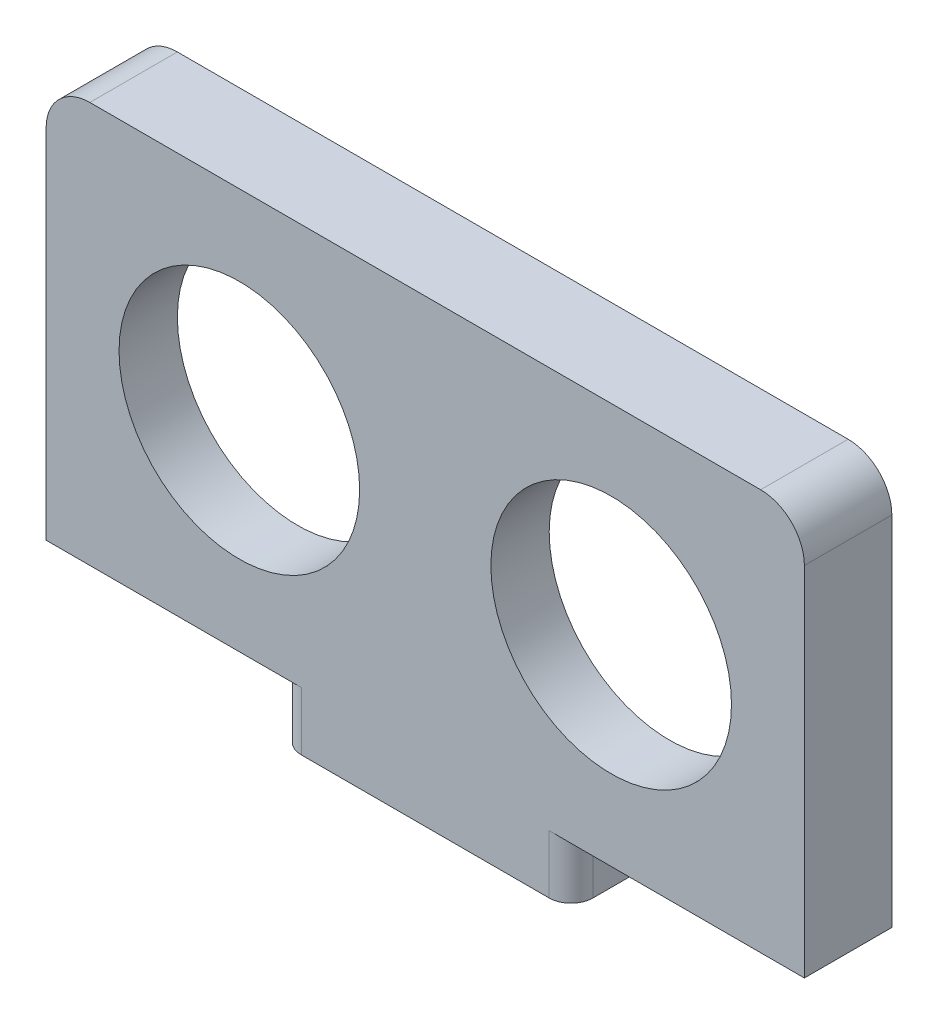
ISO-10303-21;
HEADER;
FILE_DESCRIPTION(('STEP AP214'),'2;1');
FILE_NAME('part.step','',(''),(''),'','','');
FILE_SCHEMA(('AUTOMOTIVE_DESIGN { 1 0 10303 214 1 1 1 1 }'));
ENDSEC;
DATA;
#1=APPLICATION_CONTEXT('core data for automotive mechanical design processes');
#2=APPLICATION_PROTOCOL_DEFINITION('international standard','automotive_design',2000,#1);
#3=PRODUCT_CONTEXT('',#1,'mechanical');
#4=PRODUCT('Part','Part','',(#3));
#5=PRODUCT_RELATED_PRODUCT_CATEGORY('part','',(#4));
#6=PRODUCT_DEFINITION_FORMATION('','',#4);
#7=PRODUCT_DEFINITION_CONTEXT('part definition',#1,'design');
#8=PRODUCT_DEFINITION('design','',#6,#7);
#9=PRODUCT_DEFINITION_SHAPE('','',#8);
#10=(LENGTH_UNIT() NAMED_UNIT(*) SI_UNIT(.MILLI.,.METRE.));
#11=(NAMED_UNIT(*) PLANE_ANGLE_UNIT() SI_UNIT($,.RADIAN.));
#12=(NAMED_UNIT(*) SI_UNIT($,.STERADIAN.) SOLID_ANGLE_UNIT());
#13=UNCERTAINTY_MEASURE_WITH_UNIT(LENGTH_MEASURE(1.E-05),#10,'distance_accuracy_value','');
#14=(GEOMETRIC_REPRESENTATION_CONTEXT(3) GLOBAL_UNCERTAINTY_ASSIGNED_CONTEXT((#13)) GLOBAL_UNIT_ASSIGNED_CONTEXT((#10,
#11,#12)) REPRESENTATION_CONTEXT('',''));
#15=CARTESIAN_POINT('',(0.,0.,0.));
#16=DIRECTION('',(0.,0.,1.));
#17=DIRECTION('',(1.,0.,0.));
#18=AXIS2_PLACEMENT_3D('',#15,#16,#17);
#19=CARTESIAN_POINT('',(26.,-13.75,4.));
#20=DIRECTION('',(0.,-1.,0.));
#21=DIRECTION('',(1.,0.,0.));
#22=AXIS2_PLACEMENT_3D('',#19,#20,#21);
#23=PLANE('',#22);
#24=DIRECTION('',(-1.,0.,0.));
#25=VECTOR('',#24,1.);
#26=CARTESIAN_POINT('',(26.,-13.75,4.));
#27=LINE('',#26,#25);
#28=CARTESIAN_POINT('',(26.,-13.75,4.));
#29=VERTEX_POINT('',#28);
#30=CARTESIAN_POINT('',(8.50000000000001,-13.75,4.));
#31=VERTEX_POINT('',#30);
#32=EDGE_CURVE('E410',#29,#31,#27,.T.);
#33=ORIENTED_EDGE('',*,*,#32,.T.);
#34=CARTESIAN_POINT('',(8.5,-13.75,2.5));
#35=DIRECTION('',(0.,-1.,0.));
#36=DIRECTION('',(1.,0.,0.));
#37=AXIS2_PLACEMENT_3D('',#34,#35,#36);
#38=CIRCLE('',#37,1.5);
#39=CARTESIAN_POINT('',(10.,-13.75,2.5));
#40=VERTEX_POINT('',#39);
#41=EDGE_CURVE('E12',#31,#40,#38,.F.);
#42=ORIENTED_EDGE('',*,*,#41,.T.);
#43=DIRECTION('',(0.,0.,-1.));
#44=VECTOR('',#43,1.);
#45=CARTESIAN_POINT('',(10.,-13.75,4.00000000000001));
#46=LINE('',#45,#44);
#47=CARTESIAN_POINT('',(10.,-13.75,-0.5));
#48=VERTEX_POINT('',#47);
#49=EDGE_CURVE('E521',#40,#48,#46,.T.);
#50=ORIENTED_EDGE('',*,*,#49,.T.);
#51=CARTESIAN_POINT('',(8.5,-13.75,-0.5));
#52=DIRECTION('',(0.,-1.,0.));
#53=DIRECTION('',(1.,0.,0.));
#54=AXIS2_PLACEMENT_3D('',#51,#52,#53);
#55=CIRCLE('',#54,1.5);
#56=CARTESIAN_POINT('',(8.5,-13.75,-2.));
#57=VERTEX_POINT('',#56);
#58=EDGE_CURVE('E75',#48,#57,#55,.F.);
#59=ORIENTED_EDGE('',*,*,#58,.T.);
#60=DIRECTION('',(-1.,0.,0.));
#61=VECTOR('',#60,1.);
#62=CARTESIAN_POINT('',(0.,-13.75,-2.));
#63=LINE('',#62,#61);
#64=CARTESIAN_POINT('',(26.,-13.75,-2.));
#65=VERTEX_POINT('',#64);
#66=EDGE_CURVE('E384',#65,#57,#63,.T.);
#67=ORIENTED_EDGE('',*,*,#66,.F.);
#68=DIRECTION('',(0.,0.,-1.));
#69=VECTOR('',#68,1.);
#70=CARTESIAN_POINT('',(26.,-13.75,4.));
#71=LINE('',#70,#69);
#72=EDGE_CURVE('E408',#29,#65,#71,.T.);
#73=ORIENTED_EDGE('',*,*,#72,.F.);
#74=EDGE_LOOP('',(#33,#42,#50,#59,#67,#73));
#75=FACE_BOUND('',#74,.T.);
#76=ADVANCED_FACE('F67',(#75),#23,.T.);
#77=CARTESIAN_POINT('',(0.,0.,0.));
#78=DIRECTION('',(0.,0.,1.));
#79=DIRECTION('',(1.,0.,0.));
#80=AXIS2_PLACEMENT_3D('',#77,#78,#79);
#81=PLANE('',#80);
#82=CARTESIAN_POINT('',(12.75,0.,0.));
#83=DIRECTION('',(0.,0.,1.));
#84=DIRECTION('',(1.,0.,0.));
#85=AXIS2_PLACEMENT_3D('',#82,#83,#84);
#86=CIRCLE('',#85,8.25);
#87=CARTESIAN_POINT('',(21.,0.,0.));
#88=VERTEX_POINT('',#87);
#89=EDGE_CURVE('E443',#88,#88,#86,.T.);
#90=ORIENTED_EDGE('',*,*,#89,.T.);
#91=EDGE_LOOP('',(#90));
#92=FACE_BOUND('',#91,.T.);
#93=CARTESIAN_POINT('',(-12.75,0.,0.));
#94=DIRECTION('',(0.,0.,1.));
#95=DIRECTION('',(1.,0.,0.));
#96=AXIS2_PLACEMENT_3D('',#93,#94,#95);
#97=CIRCLE('',#96,8.25);
#98=CARTESIAN_POINT('',(-4.5,0.,0.));
#99=VERTEX_POINT('',#98);
#100=EDGE_CURVE('E437',#99,#99,#97,.T.);
#101=ORIENTED_EDGE('',*,*,#100,.T.);
#102=EDGE_LOOP('',(#101));
#103=FACE_BOUND('',#102,.T.);
#104=CARTESIAN_POINT('',(-4.5,-5.75000000000001,0.));
#105=DIRECTION('',(0.,0.,1.));
#106=DIRECTION('',(1.,0.,0.));
#107=AXIS2_PLACEMENT_3D('',#104,#105,#106);
#108=CIRCLE('',#107,1.);
#109=CARTESIAN_POINT('',(-5.5,-5.75000000000001,0.));
#110=VERTEX_POINT('',#109);
#111=CARTESIAN_POINT('',(-4.5,-4.75000000000001,0.));
#112=VERTEX_POINT('',#111);
#113=EDGE_CURVE('E302',#110,#112,#108,.F.);
#114=ORIENTED_EDGE('',*,*,#113,.F.);
#115=DIRECTION('',(0.,1.,0.));
#116=VECTOR('',#115,1.);
#117=CARTESIAN_POINT('',(-5.5,0.,0.));
#118=LINE('',#117,#116);
#119=CARTESIAN_POINT('',(-5.5,-10.75,0.));
#120=VERTEX_POINT('',#119);
#121=EDGE_CURVE('E271',#120,#110,#118,.T.);
#122=ORIENTED_EDGE('',*,*,#121,.F.);
#123=DIRECTION('',(-1.,0.,0.));
#124=VECTOR('',#123,1.);
#125=CARTESIAN_POINT('',(0.,-10.75,0.));
#126=LINE('',#125,#124);
#127=CARTESIAN_POINT('',(-23.,-10.75,0.));
#128=VERTEX_POINT('',#127);
#129=EDGE_CURVE('E363',#120,#128,#126,.T.);
#130=ORIENTED_EDGE('',*,*,#129,.T.);
#131=DIRECTION('',(0.,1.,0.));
#132=VECTOR('',#131,1.);
#133=CARTESIAN_POINT('',(-23.,0.,0.));
#134=LINE('',#133,#132);
#135=CARTESIAN_POINT('',(-23.,10.75,0.));
#136=VERTEX_POINT('',#135);
#137=EDGE_CURVE('E465',#128,#136,#134,.T.);
#138=ORIENTED_EDGE('',*,*,#137,.T.);
#139=DIRECTION('',(-1.,0.,0.));
#140=VECTOR('',#139,1.);
#141=CARTESIAN_POINT('',(0.,10.75,0.));
#142=LINE('',#141,#140);
#143=CARTESIAN_POINT('',(-5.5,10.75,0.));
#144=VERTEX_POINT('',#143);
#145=EDGE_CURVE('E464',#144,#136,#142,.T.);
#146=ORIENTED_EDGE('',*,*,#145,.F.);
#147=DIRECTION('',(0.,-1.,0.));
#148=VECTOR('',#147,1.);
#149=CARTESIAN_POINT('',(-5.5,0.,0.));
#150=LINE('',#149,#148);
#151=CARTESIAN_POINT('',(-5.5,5.75000000000001,0.));
#152=VERTEX_POINT('',#151);
#153=EDGE_CURVE('E275',#144,#152,#150,.T.);
#154=ORIENTED_EDGE('',*,*,#153,.T.);
#155=CARTESIAN_POINT('',(-4.5,5.75000000000001,0.));
#156=DIRECTION('',(0.,0.,1.));
#157=DIRECTION('',(1.,0.,0.));
#158=AXIS2_PLACEMENT_3D('',#155,#156,#157);
#159=CIRCLE('',#158,1.);
#160=CARTESIAN_POINT('',(-4.5,4.75000000000001,0.));
#161=VERTEX_POINT('',#160);
#162=EDGE_CURVE('E339',#152,#161,#159,.T.);
#163=ORIENTED_EDGE('',*,*,#162,.T.);
#164=DIRECTION('',(1.,0.,0.));
#165=VECTOR('',#164,1.);
#166=CARTESIAN_POINT('',(0.,4.75000000000001,0.));
#167=LINE('',#166,#165);
#168=CARTESIAN_POINT('',(4.5,4.75000000000001,0.));
#169=VERTEX_POINT('',#168);
#170=EDGE_CURVE('E342',#161,#169,#167,.T.);
#171=ORIENTED_EDGE('',*,*,#170,.T.);
#172=CARTESIAN_POINT('',(4.5,5.75000000000001,0.));
#173=DIRECTION('',(0.,0.,1.));
#174=DIRECTION('',(1.,0.,0.));
#175=AXIS2_PLACEMENT_3D('',#172,#173,#174);
#176=CIRCLE('',#175,1.);
#177=CARTESIAN_POINT('',(5.5,5.75000000000001,0.));
#178=VERTEX_POINT('',#177);
#179=EDGE_CURVE('E345',#169,#178,#176,.T.);
#180=ORIENTED_EDGE('',*,*,#179,.T.);
#181=DIRECTION('',(0.,1.,0.));
#182=VECTOR('',#181,1.);
#183=CARTESIAN_POINT('',(5.5,0.,0.));
#184=LINE('',#183,#182);
#185=CARTESIAN_POINT('',(5.5,10.75,0.));
#186=VERTEX_POINT('',#185);
#187=EDGE_CURVE('E326',#178,#186,#184,.T.);
#188=ORIENTED_EDGE('',*,*,#187,.T.);
#189=CARTESIAN_POINT('',(23.,10.75,0.));
#190=VERTEX_POINT('',#189);
#191=EDGE_CURVE('E461',#190,#186,#142,.T.);
#192=ORIENTED_EDGE('',*,*,#191,.F.);
#193=DIRECTION('',(0.,1.,0.));
#194=VECTOR('',#193,1.);
#195=CARTESIAN_POINT('',(23.,0.,0.));
#196=LINE('',#195,#194);
#197=CARTESIAN_POINT('',(23.,-10.75,0.));
#198=VERTEX_POINT('',#197);
#199=EDGE_CURVE('E368',#198,#190,#196,.T.);
#200=ORIENTED_EDGE('',*,*,#199,.F.);
#201=CARTESIAN_POINT('',(5.5,-10.75,0.));
#202=VERTEX_POINT('',#201);
#203=EDGE_CURVE('E468',#198,#202,#126,.T.);
#204=ORIENTED_EDGE('',*,*,#203,.T.);
#205=DIRECTION('',(0.,-1.,0.));
#206=VECTOR('',#205,1.);
#207=CARTESIAN_POINT('',(5.5,0.,0.));
#208=LINE('',#207,#206);
#209=CARTESIAN_POINT('',(5.5,-5.75000000000001,0.));
#210=VERTEX_POINT('',#209);
#211=EDGE_CURVE('E306',#210,#202,#208,.T.);
#212=ORIENTED_EDGE('',*,*,#211,.F.);
#213=CARTESIAN_POINT('',(4.5,-5.75000000000001,0.));
#214=DIRECTION('',(0.,0.,1.));
#215=DIRECTION('',(1.,0.,0.));
#216=AXIS2_PLACEMENT_3D('',#213,#214,#215);
#217=CIRCLE('',#216,1.);
#218=CARTESIAN_POINT('',(4.5,-4.75000000000001,0.));
#219=VERTEX_POINT('',#218);
#220=EDGE_CURVE('E308',#219,#210,#217,.F.);
#221=ORIENTED_EDGE('',*,*,#220,.F.);
#222=DIRECTION('',(1.,0.,0.));
#223=VECTOR('',#222,1.);
#224=CARTESIAN_POINT('',(0.,-4.75000000000001,0.));
#225=LINE('',#224,#223);
#226=EDGE_CURVE('E285',#112,#219,#225,.T.);
#227=ORIENTED_EDGE('',*,*,#226,.F.);
#228=EDGE_LOOP('',(#114,#122,#130,#138,#146,#154,#163,#171,#180,#188,#192,#200,#204,#212,#221,#227));
#229=FACE_BOUND('',#228,.T.);
#230=ADVANCED_FACE('F575',(#92,#103,#229),#81,.F.);
#231=CARTESIAN_POINT('',(0.,0.,4.));
#232=DIRECTION('',(0.,0.,1.));
#233=DIRECTION('',(1.,0.,0.));
#234=AXIS2_PLACEMENT_3D('',#231,#232,#233);
#235=PLANE('',#234);
#236=CARTESIAN_POINT('',(-12.75,0.,4.));
#237=DIRECTION('',(0.,0.,1.));
#238=DIRECTION('',(1.,0.,0.));
#239=AXIS2_PLACEMENT_3D('',#236,#237,#238);
#240=CIRCLE('',#239,8.25);
#241=CARTESIAN_POINT('',(-4.5,0.,4.));
#242=VERTEX_POINT('',#241);
#243=EDGE_CURVE('E434',#242,#242,#240,.T.);
#244=ORIENTED_EDGE('',*,*,#243,.F.);
#245=EDGE_LOOP('',(#244));
#246=FACE_BOUND('',#245,.T.);
#247=CARTESIAN_POINT('',(-8.5,-13.75,4.));
#248=VERTEX_POINT('',#247);
#249=CARTESIAN_POINT('',(-26.,-13.75,4.));
#250=VERTEX_POINT('',#249);
#251=EDGE_CURVE('E417',#248,#250,#27,.T.);
#252=ORIENTED_EDGE('',*,*,#251,.F.);
#253=DIRECTION('',(0.,1.,0.));
#254=VECTOR('',#253,1.);
#255=CARTESIAN_POINT('',(-8.5,-17.75,4.));
#256=LINE('',#255,#254);
#257=CARTESIAN_POINT('',(-8.5,-17.75,4.));
#258=VERTEX_POINT('',#257);
#259=EDGE_CURVE('E496',#248,#258,#256,.F.);
#260=ORIENTED_EDGE('',*,*,#259,.T.);
#261=DIRECTION('',(1.,0.,0.));
#262=VECTOR('',#261,1.);
#263=CARTESIAN_POINT('',(-10.,-17.75,4.));
#264=LINE('',#263,#262);
#265=CARTESIAN_POINT('',(8.5,-17.75,4.00000000000001));
#266=VERTEX_POINT('',#265);
#267=EDGE_CURVE('E531',#258,#266,#264,.T.);
#268=ORIENTED_EDGE('',*,*,#267,.T.);
#269=DIRECTION('',(0.,1.,0.));
#270=VECTOR('',#269,1.);
#271=CARTESIAN_POINT('',(8.5,0.,4.));
#272=LINE('',#271,#270);
#273=EDGE_CURVE('E512',#266,#31,#272,.T.);
#274=ORIENTED_EDGE('',*,*,#273,.T.);
#275=ORIENTED_EDGE('',*,*,#32,.F.);
#276=DIRECTION('',(0.,1.,0.));
#277=VECTOR('',#276,1.);
#278=CARTESIAN_POINT('',(26.,-13.75,4.));
#279=LINE('',#278,#277);
#280=CARTESIAN_POINT('',(26.,10.75,4.));
#281=VERTEX_POINT('',#280);
#282=EDGE_CURVE('E429',#29,#281,#279,.T.);
#283=ORIENTED_EDGE('',*,*,#282,.T.);
#284=CARTESIAN_POINT('',(23.,10.75,4.));
#285=DIRECTION('',(0.,0.,1.));
#286=DIRECTION('',(1.,0.,0.));
#287=AXIS2_PLACEMENT_3D('',#284,#285,#286);
#288=CIRCLE('',#287,3.);
#289=CARTESIAN_POINT('',(23.,13.75,4.));
#290=VERTEX_POINT('',#289);
#291=EDGE_CURVE('E391',#281,#290,#288,.T.);
#292=ORIENTED_EDGE('',*,*,#291,.T.);
#293=DIRECTION('',(-1.,0.,0.));
#294=VECTOR('',#293,1.);
#295=CARTESIAN_POINT('',(26.,13.75,4.));
#296=LINE('',#295,#294);
#297=CARTESIAN_POINT('',(-23.,13.75,4.));
#298=VERTEX_POINT('',#297);
#299=EDGE_CURVE('E424',#290,#298,#296,.T.);
#300=ORIENTED_EDGE('',*,*,#299,.T.);
#301=CARTESIAN_POINT('',(-23.,10.75,4.));
#302=DIRECTION('',(0.,0.,1.));
#303=DIRECTION('',(1.,0.,0.));
#304=AXIS2_PLACEMENT_3D('',#301,#302,#303);
#305=CIRCLE('',#304,3.);
#306=CARTESIAN_POINT('',(-26.,10.75,4.));
#307=VERTEX_POINT('',#306);
#308=EDGE_CURVE('E389',#298,#307,#305,.T.);
#309=ORIENTED_EDGE('',*,*,#308,.T.);
#310=DIRECTION('',(0.,1.,0.));
#311=VECTOR('',#310,1.);
#312=CARTESIAN_POINT('',(-26.,-13.75,4.));
#313=LINE('',#312,#311);
#314=EDGE_CURVE('E413',#250,#307,#313,.T.);
#315=ORIENTED_EDGE('',*,*,#314,.F.);
#316=EDGE_LOOP('',(#252,#260,#268,#274,#275,#283,#292,#300,#309,#315));
#317=FACE_BOUND('',#316,.T.);
#318=CARTESIAN_POINT('',(12.75,0.,4.));
#319=DIRECTION('',(0.,0.,1.));
#320=DIRECTION('',(1.,0.,0.));
#321=AXIS2_PLACEMENT_3D('',#318,#319,#320);
#322=CIRCLE('',#321,8.25);
#323=CARTESIAN_POINT('',(21.,0.,4.));
#324=VERTEX_POINT('',#323);
#325=EDGE_CURVE('E440',#324,#324,#322,.T.);
#326=ORIENTED_EDGE('',*,*,#325,.F.);
#327=EDGE_LOOP('',(#326));
#328=FACE_BOUND('',#327,.T.);
#329=ADVANCED_FACE('F489',(#246,#317,#328),#235,.T.);
#330=CARTESIAN_POINT('',(26.,-13.75,4.));
#331=DIRECTION('',(-1.,0.,0.));
#332=DIRECTION('',(0.,0.,1.));
#333=AXIS2_PLACEMENT_3D('',#330,#331,#332);
#334=PLANE('',#333);
#335=DIRECTION('',(0.,1.,0.));
#336=VECTOR('',#335,1.);
#337=CARTESIAN_POINT('',(26.,0.,-2.));
#338=LINE('',#337,#336);
#339=CARTESIAN_POINT('',(26.,10.75,-2.));
#340=VERTEX_POINT('',#339);
#341=EDGE_CURVE('E378',#65,#340,#338,.T.);
#342=ORIENTED_EDGE('',*,*,#341,.T.);
#343=DIRECTION('',(0.,0.,-1.));
#344=VECTOR('',#343,1.);
#345=CARTESIAN_POINT('',(26.,10.75,4.));
#346=LINE('',#345,#344);
#347=EDGE_CURVE('E386',#340,#281,#346,.F.);
#348=ORIENTED_EDGE('',*,*,#347,.T.);
#349=ORIENTED_EDGE('',*,*,#282,.F.);
#350=ORIENTED_EDGE('',*,*,#72,.T.);
#351=EDGE_LOOP('',(#342,#348,#349,#350));
#352=FACE_BOUND('',#351,.T.);
#353=ADVANCED_FACE('F481',(#352),#334,.F.);
#354=CARTESIAN_POINT('',(26.,13.75,4.));
#355=DIRECTION('',(0.,-1.,0.));
#356=DIRECTION('',(1.,0.,0.));
#357=AXIS2_PLACEMENT_3D('',#354,#355,#356);
#358=PLANE('',#357);
#359=DIRECTION('',(-1.,0.,0.));
#360=VECTOR('',#359,1.);
#361=CARTESIAN_POINT('',(0.,13.75,-2.));
#362=LINE('',#361,#360);
#363=CARTESIAN_POINT('',(23.,13.75,-2.));
#364=VERTEX_POINT('',#363);
#365=CARTESIAN_POINT('',(-23.,13.75,-2.));
#366=VERTEX_POINT('',#365);
#367=EDGE_CURVE('E472',#364,#366,#362,.T.);
#368=ORIENTED_EDGE('',*,*,#367,.T.);
#369=DIRECTION('',(0.,0.,-1.));
#370=VECTOR('',#369,1.);
#371=CARTESIAN_POINT('',(-23.,13.75,4.));
#372=LINE('',#371,#370);
#373=EDGE_CURVE('E393',#366,#298,#372,.F.);
#374=ORIENTED_EDGE('',*,*,#373,.T.);
#375=ORIENTED_EDGE('',*,*,#299,.F.);
#376=DIRECTION('',(0.,0.,-1.));
#377=VECTOR('',#376,1.);
#378=CARTESIAN_POINT('',(23.,13.75,4.));
#379=LINE('',#378,#377);
#380=EDGE_CURVE('E395',#290,#364,#379,.T.);
#381=ORIENTED_EDGE('',*,*,#380,.T.);
#382=EDGE_LOOP('',(#368,#374,#375,#381));
#383=FACE_BOUND('',#382,.T.);
#384=ADVANCED_FACE('F491',(#383),#358,.F.);
#385=CARTESIAN_POINT('',(-26.,-13.75,4.));
#386=DIRECTION('',(-1.,0.,0.));
#387=DIRECTION('',(0.,0.,1.));
#388=AXIS2_PLACEMENT_3D('',#385,#386,#387);
#389=PLANE('',#388);
#390=ORIENTED_EDGE('',*,*,#314,.T.);
#391=DIRECTION('',(0.,0.,-1.));
#392=VECTOR('',#391,1.);
#393=CARTESIAN_POINT('',(-26.,10.75,-2.));
#394=LINE('',#393,#392);
#395=CARTESIAN_POINT('',(-26.,10.75,-2.));
#396=VERTEX_POINT('',#395);
#397=EDGE_CURVE('E402',#307,#396,#394,.T.);
#398=ORIENTED_EDGE('',*,*,#397,.T.);
#399=DIRECTION('',(0.,1.,0.));
#400=VECTOR('',#399,1.);
#401=CARTESIAN_POINT('',(-26.,0.,-2.));
#402=LINE('',#401,#400);
#403=CARTESIAN_POINT('',(-26.,-13.75,-2.));
#404=VERTEX_POINT('',#403);
#405=EDGE_CURVE('E453',#404,#396,#402,.T.);
#406=ORIENTED_EDGE('',*,*,#405,.F.);
#407=DIRECTION('',(0.,0.,-1.));
#408=VECTOR('',#407,1.);
#409=CARTESIAN_POINT('',(-26.,-13.75,4.));
#410=LINE('',#409,#408);
#411=EDGE_CURVE('E405',#250,#404,#410,.T.);
#412=ORIENTED_EDGE('',*,*,#411,.F.);
#413=EDGE_LOOP('',(#390,#398,#406,#412));
#414=FACE_BOUND('',#413,.T.);
#415=ADVANCED_FACE('F585',(#414),#389,.T.);
#416=DIRECTION('',(0.,0.,-1.));
#417=VECTOR('',#416,1.);
#418=CARTESIAN_POINT('',(-10.,-13.75,4.));
#419=LINE('',#418,#417);
#420=CARTESIAN_POINT('',(-10.,-13.75,2.5));
#421=VERTEX_POINT('',#420);
#422=CARTESIAN_POINT('',(-10.,-13.75,-0.5));
#423=VERTEX_POINT('',#422);
#424=EDGE_CURVE('E502',#421,#423,#419,.T.);
#425=ORIENTED_EDGE('',*,*,#424,.F.);
#426=CARTESIAN_POINT('',(-8.5,-13.75,2.5));
#427=DIRECTION('',(0.,-1.,0.));
#428=DIRECTION('',(1.,0.,0.));
#429=AXIS2_PLACEMENT_3D('',#426,#427,#428);
#430=CIRCLE('',#429,1.5);
#431=EDGE_CURVE('E499',#421,#248,#430,.F.);
#432=ORIENTED_EDGE('',*,*,#431,.T.);
#433=ORIENTED_EDGE('',*,*,#251,.T.);
#434=ORIENTED_EDGE('',*,*,#411,.T.);
#435=CARTESIAN_POINT('',(-8.5,-13.75,-2.));
#436=VERTEX_POINT('',#435);
#437=EDGE_CURVE('E375',#436,#404,#63,.T.);
#438=ORIENTED_EDGE('',*,*,#437,.F.);
#439=CARTESIAN_POINT('',(-8.5,-13.75,-0.5));
#440=DIRECTION('',(0.,-1.,0.));
#441=DIRECTION('',(1.,0.,0.));
#442=AXIS2_PLACEMENT_3D('',#439,#440,#441);
#443=CIRCLE('',#442,1.5);
#444=EDGE_CURVE('E506',#436,#423,#443,.F.);
#445=ORIENTED_EDGE('',*,*,#444,.T.);
#446=EDGE_LOOP('',(#425,#432,#433,#434,#438,#445));
#447=FACE_BOUND('',#446,.T.);
#448=ADVANCED_FACE('F500',(#447),#23,.T.);
#449=CARTESIAN_POINT('',(-12.75,0.,4.));
#450=DIRECTION('',(0.,0.,-1.));
#451=DIRECTION('',(-1.,0.,0.));
#452=AXIS2_PLACEMENT_3D('',#449,#450,#451);
#453=CYLINDRICAL_SURFACE('',#452,8.25);
#454=ORIENTED_EDGE('',*,*,#243,.T.);
#455=EDGE_LOOP('',(#454));
#456=FACE_BOUND('',#455,.T.);
#457=ORIENTED_EDGE('',*,*,#100,.F.);
#458=EDGE_LOOP('',(#457));
#459=FACE_BOUND('',#458,.T.);
#460=ADVANCED_FACE('F584',(#456,#459),#453,.F.);
#461=CARTESIAN_POINT('',(12.75,0.,4.));
#462=DIRECTION('',(0.,0.,-1.));
#463=DIRECTION('',(-1.,0.,0.));
#464=AXIS2_PLACEMENT_3D('',#461,#462,#463);
#465=CYLINDRICAL_SURFACE('',#464,8.25);
#466=ORIENTED_EDGE('',*,*,#325,.T.);
#467=EDGE_LOOP('',(#466));
#468=FACE_BOUND('',#467,.T.);
#469=ORIENTED_EDGE('',*,*,#89,.F.);
#470=EDGE_LOOP('',(#469));
#471=FACE_BOUND('',#470,.T.);
#472=ADVANCED_FACE('F590',(#468,#471),#465,.F.);
#473=CARTESIAN_POINT('',(0.,-10.75,-2.));
#474=DIRECTION('',(0.,1.,0.));
#475=DIRECTION('',(-1.,0.,0.));
#476=AXIS2_PLACEMENT_3D('',#473,#474,#475);
#477=PLANE('',#476);
#478=ORIENTED_EDGE('',*,*,#203,.F.);
#479=DIRECTION('',(0.,0.,1.));
#480=VECTOR('',#479,1.);
#481=CARTESIAN_POINT('',(23.,-10.75,-2.));
#482=LINE('',#481,#480);
#483=CARTESIAN_POINT('',(23.,-10.75,-2.));
#484=VERTEX_POINT('',#483);
#485=EDGE_CURVE('E446',#484,#198,#482,.T.);
#486=ORIENTED_EDGE('',*,*,#485,.F.);
#487=DIRECTION('',(-1.,0.,0.));
#488=VECTOR('',#487,1.);
#489=CARTESIAN_POINT('',(0.,-10.75,-2.));
#490=LINE('',#489,#488);
#491=CARTESIAN_POINT('',(-23.,-10.75,-2.));
#492=VERTEX_POINT('',#491);
#493=EDGE_CURVE('E364',#484,#492,#490,.T.);
#494=ORIENTED_EDGE('',*,*,#493,.T.);
#495=DIRECTION('',(0.,0.,1.));
#496=VECTOR('',#495,1.);
#497=CARTESIAN_POINT('',(-23.,-10.75,-2.));
#498=LINE('',#497,#496);
#499=EDGE_CURVE('E449',#492,#128,#498,.T.);
#500=ORIENTED_EDGE('',*,*,#499,.T.);
#501=ORIENTED_EDGE('',*,*,#129,.F.);
#502=DIRECTION('',(0.,0.,-1.));
#503=VECTOR('',#502,1.);
#504=CARTESIAN_POINT('',(-5.5,-10.75,3.));
#505=LINE('',#504,#503);
#506=CARTESIAN_POINT('',(-5.5,-10.75,3.));
#507=VERTEX_POINT('',#506);
#508=EDGE_CURVE('E276',#507,#120,#505,.T.);
#509=ORIENTED_EDGE('',*,*,#508,.F.);
#510=DIRECTION('',(-1.,0.,0.));
#511=VECTOR('',#510,1.);
#512=CARTESIAN_POINT('',(0.,-10.75,3.));
#513=LINE('',#512,#511);
#514=CARTESIAN_POINT('',(5.5,-10.75,3.));
#515=VERTEX_POINT('',#514);
#516=EDGE_CURVE('E290',#515,#507,#513,.T.);
#517=ORIENTED_EDGE('',*,*,#516,.F.);
#518=DIRECTION('',(0.,0.,-1.));
#519=VECTOR('',#518,1.);
#520=CARTESIAN_POINT('',(5.5,-10.75,3.));
#521=LINE('',#520,#519);
#522=EDGE_CURVE('E318',#515,#202,#521,.T.);
#523=ORIENTED_EDGE('',*,*,#522,.T.);
#524=EDGE_LOOP('',(#478,#486,#494,#500,#501,#509,#517,#523));
#525=FACE_BOUND('',#524,.T.);
#526=ADVANCED_FACE('F847',(#525),#477,.T.);
#527=CARTESIAN_POINT('',(23.,0.,-2.));
#528=DIRECTION('',(1.,0.,0.));
#529=DIRECTION('',(0.,0.,-1.));
#530=AXIS2_PLACEMENT_3D('',#527,#528,#529);
#531=PLANE('',#530);
#532=ORIENTED_EDGE('',*,*,#199,.T.);
#533=DIRECTION('',(0.,0.,1.));
#534=VECTOR('',#533,1.);
#535=CARTESIAN_POINT('',(23.,10.75,-2.));
#536=LINE('',#535,#534);
#537=CARTESIAN_POINT('',(23.,10.75,-2.));
#538=VERTEX_POINT('',#537);
#539=EDGE_CURVE('E456',#538,#190,#536,.T.);
#540=ORIENTED_EDGE('',*,*,#539,.F.);
#541=DIRECTION('',(0.,1.,0.));
#542=VECTOR('',#541,1.);
#543=CARTESIAN_POINT('',(23.,0.,-2.));
#544=LINE('',#543,#542);
#545=EDGE_CURVE('E373',#484,#538,#544,.T.);
#546=ORIENTED_EDGE('',*,*,#545,.F.);
#547=ORIENTED_EDGE('',*,*,#485,.T.);
#548=EDGE_LOOP('',(#532,#540,#546,#547));
#549=FACE_BOUND('',#548,.T.);
#550=ADVANCED_FACE('F837',(#549),#531,.F.);
#551=CARTESIAN_POINT('',(0.,10.75,-2.));
#552=DIRECTION('',(0.,1.,0.));
#553=DIRECTION('',(-1.,0.,0.));
#554=AXIS2_PLACEMENT_3D('',#551,#552,#553);
#555=PLANE('',#554);
#556=ORIENTED_EDGE('',*,*,#191,.T.);
#557=DIRECTION('',(0.,0.,-1.));
#558=VECTOR('',#557,1.);
#559=CARTESIAN_POINT('',(5.5,10.75,3.));
#560=LINE('',#559,#558);
#561=CARTESIAN_POINT('',(5.5,10.75,3.));
#562=VERTEX_POINT('',#561);
#563=EDGE_CURVE('E352',#562,#186,#560,.T.);
#564=ORIENTED_EDGE('',*,*,#563,.F.);
#565=DIRECTION('',(-1.,0.,0.));
#566=VECTOR('',#565,1.);
#567=CARTESIAN_POINT('',(0.,10.75,3.));
#568=LINE('',#567,#566);
#569=CARTESIAN_POINT('',(-5.5,10.75,3.));
#570=VERTEX_POINT('',#569);
#571=EDGE_CURVE('E334',#562,#570,#568,.T.);
#572=ORIENTED_EDGE('',*,*,#571,.T.);
#573=DIRECTION('',(0.,0.,-1.));
#574=VECTOR('',#573,1.);
#575=CARTESIAN_POINT('',(-5.5,10.75,3.));
#576=LINE('',#575,#574);
#577=EDGE_CURVE('E336',#570,#144,#576,.T.);
#578=ORIENTED_EDGE('',*,*,#577,.T.);
#579=ORIENTED_EDGE('',*,*,#145,.T.);
#580=DIRECTION('',(0.,0.,1.));
#581=VECTOR('',#580,1.);
#582=CARTESIAN_POINT('',(-23.,10.75,-2.));
#583=LINE('',#582,#581);
#584=CARTESIAN_POINT('',(-23.,10.75,-2.));
#585=VERTEX_POINT('',#584);
#586=EDGE_CURVE('E452',#585,#136,#583,.T.);
#587=ORIENTED_EDGE('',*,*,#586,.F.);
#588=DIRECTION('',(-1.,0.,0.));
#589=VECTOR('',#588,1.);
#590=CARTESIAN_POINT('',(0.,10.75,-2.));
#591=LINE('',#590,#589);
#592=EDGE_CURVE('E371',#538,#585,#591,.T.);
#593=ORIENTED_EDGE('',*,*,#592,.F.);
#594=ORIENTED_EDGE('',*,*,#539,.T.);
#595=EDGE_LOOP('',(#556,#564,#572,#578,#579,#587,#593,#594));
#596=FACE_BOUND('',#595,.T.);
#597=ADVANCED_FACE('F833',(#596),#555,.F.);
#598=CARTESIAN_POINT('',(-23.,0.,-2.));
#599=DIRECTION('',(1.,0.,0.));
#600=DIRECTION('',(0.,0.,-1.));
#601=AXIS2_PLACEMENT_3D('',#598,#599,#600);
#602=PLANE('',#601);
#603=ORIENTED_EDGE('',*,*,#137,.F.);
#604=ORIENTED_EDGE('',*,*,#499,.F.);
#605=DIRECTION('',(0.,1.,0.));
#606=VECTOR('',#605,1.);
#607=CARTESIAN_POINT('',(-23.,0.,-2.));
#608=LINE('',#607,#606);
#609=EDGE_CURVE('E367',#492,#585,#608,.T.);
#610=ORIENTED_EDGE('',*,*,#609,.T.);
#611=ORIENTED_EDGE('',*,*,#586,.T.);
#612=EDGE_LOOP('',(#603,#604,#610,#611));
#613=FACE_BOUND('',#612,.T.);
#614=ADVANCED_FACE('F660',(#613),#602,.T.);
#615=CARTESIAN_POINT('',(0.,0.,-2.));
#616=DIRECTION('',(0.,0.,1.));
#617=DIRECTION('',(1.,0.,0.));
#618=AXIS2_PLACEMENT_3D('',#615,#616,#617);
#619=PLANE('',#618);
#620=ORIENTED_EDGE('',*,*,#493,.F.);
#621=ORIENTED_EDGE('',*,*,#545,.T.);
#622=ORIENTED_EDGE('',*,*,#592,.T.);
#623=ORIENTED_EDGE('',*,*,#609,.F.);
#624=EDGE_LOOP('',(#620,#621,#622,#623));
#625=FACE_BOUND('',#624,.T.);
#626=DIRECTION('',(1.,0.,0.));
#627=VECTOR('',#626,1.);
#628=CARTESIAN_POINT('',(-10.,-17.75,-2.));
#629=LINE('',#628,#627);
#630=CARTESIAN_POINT('',(-8.5,-17.75,-2.));
#631=VERTEX_POINT('',#630);
#632=CARTESIAN_POINT('',(8.5,-17.75,-2.));
#633=VERTEX_POINT('',#632);
#634=EDGE_CURVE('E547',#631,#633,#629,.T.);
#635=ORIENTED_EDGE('',*,*,#634,.F.);
#636=DIRECTION('',(0.,1.,0.));
#637=VECTOR('',#636,1.);
#638=CARTESIAN_POINT('',(-8.5,0.,-2.));
#639=LINE('',#638,#637);
#640=EDGE_CURVE('E532',#631,#436,#639,.T.);
#641=ORIENTED_EDGE('',*,*,#640,.T.);
#642=ORIENTED_EDGE('',*,*,#437,.T.);
#643=ORIENTED_EDGE('',*,*,#405,.T.);
#644=CARTESIAN_POINT('',(-23.,10.75,-2.));
#645=DIRECTION('',(0.,0.,1.));
#646=DIRECTION('',(1.,0.,0.));
#647=AXIS2_PLACEMENT_3D('',#644,#645,#646);
#648=CIRCLE('',#647,3.);
#649=EDGE_CURVE('E398',#396,#366,#648,.F.);
#650=ORIENTED_EDGE('',*,*,#649,.T.);
#651=ORIENTED_EDGE('',*,*,#367,.F.);
#652=CARTESIAN_POINT('',(23.,10.75,-2.));
#653=DIRECTION('',(0.,0.,1.));
#654=DIRECTION('',(1.,0.,0.));
#655=AXIS2_PLACEMENT_3D('',#652,#653,#654);
#656=CIRCLE('',#655,3.);
#657=EDGE_CURVE('E400',#364,#340,#656,.F.);
#658=ORIENTED_EDGE('',*,*,#657,.T.);
#659=ORIENTED_EDGE('',*,*,#341,.F.);
#660=ORIENTED_EDGE('',*,*,#66,.T.);
#661=DIRECTION('',(0.,1.,0.));
#662=VECTOR('',#661,1.);
#663=CARTESIAN_POINT('',(8.5,-17.75,-2.));
#664=LINE('',#663,#662);
#665=EDGE_CURVE('E388',#57,#633,#664,.F.);
#666=ORIENTED_EDGE('',*,*,#665,.T.);
#667=EDGE_LOOP('',(#635,#641,#642,#643,#650,#651,#658,#659,#660,#666));
#668=FACE_BOUND('',#667,.T.);
#669=ADVANCED_FACE('F554',(#625,#668),#619,.F.);
#670=CARTESIAN_POINT('',(-5.5,0.,3.));
#671=DIRECTION('',(1.,0.,0.));
#672=DIRECTION('',(0.,0.,-1.));
#673=AXIS2_PLACEMENT_3D('',#670,#671,#672);
#674=PLANE('',#673);
#675=ORIENTED_EDGE('',*,*,#153,.F.);
#676=ORIENTED_EDGE('',*,*,#577,.F.);
#677=DIRECTION('',(0.,-1.,0.));
#678=VECTOR('',#677,1.);
#679=CARTESIAN_POINT('',(-5.5,0.,3.));
#680=LINE('',#679,#678);
#681=CARTESIAN_POINT('',(-5.5,5.75000000000001,3.));
#682=VERTEX_POINT('',#681);
#683=EDGE_CURVE('E322',#570,#682,#680,.T.);
#684=ORIENTED_EDGE('',*,*,#683,.T.);
#685=DIRECTION('',(0.,0.,-1.));
#686=VECTOR('',#685,1.);
#687=CARTESIAN_POINT('',(-5.5,5.75000000000001,3.));
#688=LINE('',#687,#686);
#689=EDGE_CURVE('E360',#682,#152,#688,.T.);
#690=ORIENTED_EDGE('',*,*,#689,.T.);
#691=EDGE_LOOP('',(#675,#676,#684,#690));
#692=FACE_BOUND('',#691,.T.);
#693=ADVANCED_FACE('F659',(#692),#674,.T.);
#694=CARTESIAN_POINT('',(-4.5,5.75000000000001,3.));
#695=DIRECTION('',(0.,0.,-1.));
#696=DIRECTION('',(-1.,0.,0.));
#697=AXIS2_PLACEMENT_3D('',#694,#695,#696);
#698=CYLINDRICAL_SURFACE('',#697,1.);
#699=ORIENTED_EDGE('',*,*,#162,.F.);
#700=ORIENTED_EDGE('',*,*,#689,.F.);
#701=CARTESIAN_POINT('',(-4.5,5.75000000000001,3.));
#702=DIRECTION('',(0.,0.,1.));
#703=DIRECTION('',(1.,0.,0.));
#704=AXIS2_PLACEMENT_3D('',#701,#702,#703);
#705=CIRCLE('',#704,1.);
#706=CARTESIAN_POINT('',(-4.5,4.75000000000001,3.));
#707=VERTEX_POINT('',#706);
#708=EDGE_CURVE('E325',#682,#707,#705,.T.);
#709=ORIENTED_EDGE('',*,*,#708,.T.);
#710=DIRECTION('',(0.,0.,-1.));
#711=VECTOR('',#710,1.);
#712=CARTESIAN_POINT('',(-4.5,4.75000000000001,3.));
#713=LINE('',#712,#711);
#714=EDGE_CURVE('E358',#707,#161,#713,.T.);
#715=ORIENTED_EDGE('',*,*,#714,.T.);
#716=EDGE_LOOP('',(#699,#700,#709,#715));
#717=FACE_BOUND('',#716,.T.);
#718=ADVANCED_FACE('F808',(#717),#698,.F.);
#719=CARTESIAN_POINT('',(0.,4.75000000000001,3.));
#720=DIRECTION('',(0.,1.,0.));
#721=DIRECTION('',(0.,0.,1.));
#722=AXIS2_PLACEMENT_3D('',#719,#720,#721);
#723=PLANE('',#722);
#724=ORIENTED_EDGE('',*,*,#170,.F.);
#725=ORIENTED_EDGE('',*,*,#714,.F.);
#726=DIRECTION('',(1.,0.,0.));
#727=VECTOR('',#726,1.);
#728=CARTESIAN_POINT('',(0.,4.75000000000001,3.));
#729=LINE('',#728,#727);
#730=CARTESIAN_POINT('',(4.5,4.75000000000001,3.));
#731=VERTEX_POINT('',#730);
#732=EDGE_CURVE('E328',#707,#731,#729,.T.);
#733=ORIENTED_EDGE('',*,*,#732,.T.);
#734=DIRECTION('',(0.,0.,-1.));
#735=VECTOR('',#734,1.);
#736=CARTESIAN_POINT('',(4.5,4.75000000000001,3.));
#737=LINE('',#736,#735);
#738=EDGE_CURVE('E356',#731,#169,#737,.T.);
#739=ORIENTED_EDGE('',*,*,#738,.T.);
#740=EDGE_LOOP('',(#724,#725,#733,#739));
#741=FACE_BOUND('',#740,.T.);
#742=ADVANCED_FACE('F798',(#741),#723,.T.);
#743=CARTESIAN_POINT('',(4.5,5.75000000000001,3.));
#744=DIRECTION('',(0.,0.,-1.));
#745=DIRECTION('',(-1.,0.,0.));
#746=AXIS2_PLACEMENT_3D('',#743,#744,#745);
#747=CYLINDRICAL_SURFACE('',#746,1.);
#748=ORIENTED_EDGE('',*,*,#179,.F.);
#749=ORIENTED_EDGE('',*,*,#738,.F.);
#750=CARTESIAN_POINT('',(4.5,5.75000000000001,3.));
#751=DIRECTION('',(0.,0.,1.));
#752=DIRECTION('',(1.,0.,0.));
#753=AXIS2_PLACEMENT_3D('',#750,#751,#752);
#754=CIRCLE('',#753,1.);
#755=CARTESIAN_POINT('',(5.5,5.75000000000001,3.));
#756=VERTEX_POINT('',#755);
#757=EDGE_CURVE('E330',#731,#756,#754,.T.);
#758=ORIENTED_EDGE('',*,*,#757,.T.);
#759=DIRECTION('',(0.,0.,-1.));
#760=VECTOR('',#759,1.);
#761=CARTESIAN_POINT('',(5.5,5.75000000000001,3.));
#762=LINE('',#761,#760);
#763=EDGE_CURVE('E354',#756,#178,#762,.T.);
#764=ORIENTED_EDGE('',*,*,#763,.T.);
#765=EDGE_LOOP('',(#748,#749,#758,#764));
#766=FACE_BOUND('',#765,.T.);
#767=ADVANCED_FACE('F788',(#766),#747,.F.);
#768=CARTESIAN_POINT('',(5.5,0.,3.));
#769=DIRECTION('',(-1.,0.,0.));
#770=DIRECTION('',(0.,0.,1.));
#771=AXIS2_PLACEMENT_3D('',#768,#769,#770);
#772=PLANE('',#771);
#773=ORIENTED_EDGE('',*,*,#187,.F.);
#774=ORIENTED_EDGE('',*,*,#763,.F.);
#775=DIRECTION('',(0.,1.,0.));
#776=VECTOR('',#775,1.);
#777=CARTESIAN_POINT('',(5.5,0.,3.));
#778=LINE('',#777,#776);
#779=EDGE_CURVE('E332',#756,#562,#778,.T.);
#780=ORIENTED_EDGE('',*,*,#779,.T.);
#781=ORIENTED_EDGE('',*,*,#563,.T.);
#782=EDGE_LOOP('',(#773,#774,#780,#781));
#783=FACE_BOUND('',#782,.T.);
#784=ADVANCED_FACE('F778',(#783),#772,.T.);
#785=CARTESIAN_POINT('',(0.,0.,3.));
#786=DIRECTION('',(0.,0.,1.));
#787=DIRECTION('',(1.,0.,0.));
#788=AXIS2_PLACEMENT_3D('',#785,#786,#787);
#789=PLANE('',#788);
#790=ORIENTED_EDGE('',*,*,#683,.F.);
#791=ORIENTED_EDGE('',*,*,#571,.F.);
#792=ORIENTED_EDGE('',*,*,#779,.F.);
#793=ORIENTED_EDGE('',*,*,#757,.F.);
#794=ORIENTED_EDGE('',*,*,#732,.F.);
#795=ORIENTED_EDGE('',*,*,#708,.F.);
#796=EDGE_LOOP('',(#790,#791,#792,#793,#794,#795));
#797=FACE_BOUND('',#796,.T.);
#798=ADVANCED_FACE('F769',(#797),#789,.F.);
#799=CARTESIAN_POINT('',(-4.5,-5.75000000000001,3.));
#800=DIRECTION('',(0.,0.,-1.));
#801=DIRECTION('',(-1.,0.,0.));
#802=AXIS2_PLACEMENT_3D('',#799,#800,#801);
#803=CYLINDRICAL_SURFACE('',#802,1.);
#804=ORIENTED_EDGE('',*,*,#113,.T.);
#805=DIRECTION('',(0.,0.,-1.));
#806=VECTOR('',#805,1.);
#807=CARTESIAN_POINT('',(-4.5,-4.75000000000001,3.));
#808=LINE('',#807,#806);
#809=CARTESIAN_POINT('',(-4.5,-4.75000000000001,3.));
#810=VERTEX_POINT('',#809);
#811=EDGE_CURVE('E281',#810,#112,#808,.T.);
#812=ORIENTED_EDGE('',*,*,#811,.F.);
#813=CARTESIAN_POINT('',(-4.5,-5.75000000000001,3.));
#814=DIRECTION('',(0.,0.,1.));
#815=DIRECTION('',(1.,0.,0.));
#816=AXIS2_PLACEMENT_3D('',#813,#814,#815);
#817=CIRCLE('',#816,1.);
#818=CARTESIAN_POINT('',(-5.5,-5.75000000000001,3.));
#819=VERTEX_POINT('',#818);
#820=EDGE_CURVE('E279',#819,#810,#817,.F.);
#821=ORIENTED_EDGE('',*,*,#820,.F.);
#822=DIRECTION('',(0.,0.,-1.));
#823=VECTOR('',#822,1.);
#824=CARTESIAN_POINT('',(-5.5,-5.75000000000001,3.));
#825=LINE('',#824,#823);
#826=EDGE_CURVE('E264',#819,#110,#825,.T.);
#827=ORIENTED_EDGE('',*,*,#826,.T.);
#828=EDGE_LOOP('',(#804,#812,#821,#827));
#829=FACE_BOUND('',#828,.T.);
#830=ADVANCED_FACE('F280',(#829),#803,.F.);
#831=CARTESIAN_POINT('',(-5.5,0.,3.));
#832=DIRECTION('',(-1.,0.,0.));
#833=DIRECTION('',(0.,0.,1.));
#834=AXIS2_PLACEMENT_3D('',#831,#832,#833);
#835=PLANE('',#834);
#836=ORIENTED_EDGE('',*,*,#121,.T.);
#837=ORIENTED_EDGE('',*,*,#826,.F.);
#838=DIRECTION('',(0.,1.,0.));
#839=VECTOR('',#838,1.);
#840=CARTESIAN_POINT('',(-5.5,0.,3.));
#841=LINE('',#840,#839);
#842=EDGE_CURVE('E268',#507,#819,#841,.T.);
#843=ORIENTED_EDGE('',*,*,#842,.F.);
#844=ORIENTED_EDGE('',*,*,#508,.T.);
#845=EDGE_LOOP('',(#836,#837,#843,#844));
#846=FACE_BOUND('',#845,.T.);
#847=ADVANCED_FACE('F266',(#846),#835,.F.);
#848=CARTESIAN_POINT('',(5.5,0.,3.));
#849=DIRECTION('',(1.,0.,0.));
#850=DIRECTION('',(0.,0.,-1.));
#851=AXIS2_PLACEMENT_3D('',#848,#849,#850);
#852=PLANE('',#851);
#853=ORIENTED_EDGE('',*,*,#211,.T.);
#854=ORIENTED_EDGE('',*,*,#522,.F.);
#855=DIRECTION('',(0.,-1.,0.));
#856=VECTOR('',#855,1.);
#857=CARTESIAN_POINT('',(5.5,0.,3.));
#858=LINE('',#857,#856);
#859=CARTESIAN_POINT('',(5.5,-5.75000000000001,3.));
#860=VERTEX_POINT('',#859);
#861=EDGE_CURVE('E292',#860,#515,#858,.T.);
#862=ORIENTED_EDGE('',*,*,#861,.F.);
#863=DIRECTION('',(0.,0.,-1.));
#864=VECTOR('',#863,1.);
#865=CARTESIAN_POINT('',(5.5,-5.75000000000001,3.));
#866=LINE('',#865,#864);
#867=EDGE_CURVE('E316',#860,#210,#866,.T.);
#868=ORIENTED_EDGE('',*,*,#867,.T.);
#869=EDGE_LOOP('',(#853,#854,#862,#868));
#870=FACE_BOUND('',#869,.T.);
#871=ADVANCED_FACE('F742',(#870),#852,.F.);
#872=CARTESIAN_POINT('',(4.5,-5.75000000000001,3.));
#873=DIRECTION('',(0.,0.,-1.));
#874=DIRECTION('',(-1.,0.,0.));
#875=AXIS2_PLACEMENT_3D('',#872,#873,#874);
#876=CYLINDRICAL_SURFACE('',#875,1.);
#877=ORIENTED_EDGE('',*,*,#220,.T.);
#878=ORIENTED_EDGE('',*,*,#867,.F.);
#879=CARTESIAN_POINT('',(4.5,-5.75000000000001,3.));
#880=DIRECTION('',(0.,0.,1.));
#881=DIRECTION('',(1.,0.,0.));
#882=AXIS2_PLACEMENT_3D('',#879,#880,#881);
#883=CIRCLE('',#882,1.);
#884=CARTESIAN_POINT('',(4.5,-4.75000000000001,3.));
#885=VERTEX_POINT('',#884);
#886=EDGE_CURVE('E297',#885,#860,#883,.F.);
#887=ORIENTED_EDGE('',*,*,#886,.F.);
#888=DIRECTION('',(0.,0.,-1.));
#889=VECTOR('',#888,1.);
#890=CARTESIAN_POINT('',(4.5,-4.75000000000001,3.));
#891=LINE('',#890,#889);
#892=EDGE_CURVE('E314',#885,#219,#891,.T.);
#893=ORIENTED_EDGE('',*,*,#892,.T.);
#894=EDGE_LOOP('',(#877,#878,#887,#893));
#895=FACE_BOUND('',#894,.T.);
#896=ADVANCED_FACE('F732',(#895),#876,.F.);
#897=CARTESIAN_POINT('',(0.,-4.75000000000001,3.));
#898=DIRECTION('',(0.,1.,0.));
#899=DIRECTION('',(0.,0.,1.));
#900=AXIS2_PLACEMENT_3D('',#897,#898,#899);
#901=PLANE('',#900);
#902=ORIENTED_EDGE('',*,*,#226,.T.);
#903=ORIENTED_EDGE('',*,*,#892,.F.);
#904=DIRECTION('',(1.,0.,0.));
#905=VECTOR('',#904,1.);
#906=CARTESIAN_POINT('',(0.,-4.75000000000001,3.));
#907=LINE('',#906,#905);
#908=EDGE_CURVE('E300',#810,#885,#907,.T.);
#909=ORIENTED_EDGE('',*,*,#908,.F.);
#910=ORIENTED_EDGE('',*,*,#811,.T.);
#911=EDGE_LOOP('',(#902,#903,#909,#910));
#912=FACE_BOUND('',#911,.T.);
#913=ADVANCED_FACE('F723',(#912),#901,.F.);
#914=CARTESIAN_POINT('',(0.,0.,3.));
#915=DIRECTION('',(0.,0.,1.));
#916=DIRECTION('',(1.,0.,0.));
#917=AXIS2_PLACEMENT_3D('',#914,#915,#916);
#918=PLANE('',#917);
#919=ORIENTED_EDGE('',*,*,#820,.T.);
#920=ORIENTED_EDGE('',*,*,#908,.T.);
#921=ORIENTED_EDGE('',*,*,#886,.T.);
#922=ORIENTED_EDGE('',*,*,#861,.T.);
#923=ORIENTED_EDGE('',*,*,#516,.T.);
#924=ORIENTED_EDGE('',*,*,#842,.T.);
#925=EDGE_LOOP('',(#919,#920,#921,#922,#923,#924));
#926=FACE_BOUND('',#925,.T.);
#927=ADVANCED_FACE('F287',(#926),#918,.F.);
#928=CARTESIAN_POINT('',(-23.,10.75,4.));
#929=DIRECTION('',(0.,0.,1.));
#930=DIRECTION('',(1.,0.,0.));
#931=AXIS2_PLACEMENT_3D('',#928,#929,#930);
#932=CYLINDRICAL_SURFACE('',#931,3.);
#933=ORIENTED_EDGE('',*,*,#308,.F.);
#934=ORIENTED_EDGE('',*,*,#373,.F.);
#935=ORIENTED_EDGE('',*,*,#649,.F.);
#936=ORIENTED_EDGE('',*,*,#397,.F.);
#937=EDGE_LOOP('',(#933,#934,#935,#936));
#938=FACE_BOUND('',#937,.T.);
#939=ADVANCED_FACE('F493',(#938),#932,.T.);
#940=CARTESIAN_POINT('',(23.,10.75,4.));
#941=DIRECTION('',(0.,0.,-1.));
#942=DIRECTION('',(-1.,0.,0.));
#943=AXIS2_PLACEMENT_3D('',#940,#941,#942);
#944=CYLINDRICAL_SURFACE('',#943,3.);
#945=ORIENTED_EDGE('',*,*,#291,.F.);
#946=ORIENTED_EDGE('',*,*,#347,.F.);
#947=ORIENTED_EDGE('',*,*,#657,.F.);
#948=ORIENTED_EDGE('',*,*,#380,.F.);
#949=EDGE_LOOP('',(#945,#946,#947,#948));
#950=FACE_BOUND('',#949,.T.);
#951=ADVANCED_FACE('F487',(#950),#944,.T.);
#952=CARTESIAN_POINT('',(-10.,-17.75,4.));
#953=DIRECTION('',(1.,0.,0.));
#954=DIRECTION('',(0.,1.,0.));
#955=AXIS2_PLACEMENT_3D('',#952,#953,#954);
#956=PLANE('',#955);
#957=ORIENTED_EDGE('',*,*,#424,.T.);
#958=DIRECTION('',(0.,1.,0.));
#959=VECTOR('',#958,1.);
#960=CARTESIAN_POINT('',(-10.,-17.75,-0.5));
#961=LINE('',#960,#959);
#962=CARTESIAN_POINT('',(-10.,-17.75,-0.5));
#963=VERTEX_POINT('',#962);
#964=EDGE_CURVE('E535',#423,#963,#961,.F.);
#965=ORIENTED_EDGE('',*,*,#964,.T.);
#966=DIRECTION('',(0.,0.,-1.));
#967=VECTOR('',#966,1.);
#968=CARTESIAN_POINT('',(-10.,-17.75,4.));
#969=LINE('',#968,#967);
#970=CARTESIAN_POINT('',(-10.,-17.75,2.5));
#971=VERTEX_POINT('',#970);
#972=EDGE_CURVE('E304',#971,#963,#969,.T.);
#973=ORIENTED_EDGE('',*,*,#972,.F.);
#974=DIRECTION('',(0.,1.,0.));
#975=VECTOR('',#974,1.);
#976=CARTESIAN_POINT('',(-10.,-13.75,2.5));
#977=LINE('',#976,#975);
#978=EDGE_CURVE('E533',#971,#421,#977,.T.);
#979=ORIENTED_EDGE('',*,*,#978,.T.);
#980=EDGE_LOOP('',(#957,#965,#973,#979));
#981=FACE_BOUND('',#980,.T.);
#982=ADVANCED_FACE('F604',(#981),#956,.F.);
#983=CARTESIAN_POINT('',(10.,-17.75,4.00000000000001));
#984=DIRECTION('',(1.,0.,0.));
#985=DIRECTION('',(0.,1.,0.));
#986=AXIS2_PLACEMENT_3D('',#983,#984,#985);
#987=PLANE('',#986);
#988=DIRECTION('',(0.,0.,-1.));
#989=VECTOR('',#988,1.);
#990=CARTESIAN_POINT('',(10.,-17.75,4.00000000000001));
#991=LINE('',#990,#989);
#992=CARTESIAN_POINT('',(10.,-17.75,2.5));
#993=VERTEX_POINT('',#992);
#994=CARTESIAN_POINT('',(10.,-17.75,-0.5));
#995=VERTEX_POINT('',#994);
#996=EDGE_CURVE('E555',#993,#995,#991,.T.);
#997=ORIENTED_EDGE('',*,*,#996,.T.);
#998=DIRECTION('',(0.,1.,0.));
#999=VECTOR('',#998,1.);
#1000=CARTESIAN_POINT('',(10.,-13.75,-0.5));
#1001=LINE('',#1000,#999);
#1002=EDGE_CURVE('E514',#995,#48,#1001,.T.);
#1003=ORIENTED_EDGE('',*,*,#1002,.T.);
#1004=ORIENTED_EDGE('',*,*,#49,.F.);
#1005=DIRECTION('',(0.,1.,0.));
#1006=VECTOR('',#1005,1.);
#1007=CARTESIAN_POINT('',(10.,-17.75,2.5));
#1008=LINE('',#1007,#1006);
#1009=EDGE_CURVE('E511',#40,#993,#1008,.F.);
#1010=ORIENTED_EDGE('',*,*,#1009,.T.);
#1011=EDGE_LOOP('',(#997,#1003,#1004,#1010));
#1012=FACE_BOUND('',#1011,.T.);
#1013=ADVANCED_FACE('F564',(#1012),#987,.T.);
#1014=CARTESIAN_POINT('',(0.,-17.75,0.));
#1015=DIRECTION('',(0.,1.,0.));
#1016=DIRECTION('',(-1.,0.,0.));
#1017=AXIS2_PLACEMENT_3D('',#1014,#1015,#1016);
#1018=PLANE('',#1017);
#1019=ORIENTED_EDGE('',*,*,#972,.T.);
#1020=CARTESIAN_POINT('',(-8.5,-17.75,-0.5));
#1021=DIRECTION('',(0.,1.,0.));
#1022=DIRECTION('',(-1.,0.,0.));
#1023=AXIS2_PLACEMENT_3D('',#1020,#1021,#1022);
#1024=CIRCLE('',#1023,1.5);
#1025=EDGE_CURVE('E517',#963,#631,#1024,.F.);
#1026=ORIENTED_EDGE('',*,*,#1025,.T.);
#1027=ORIENTED_EDGE('',*,*,#634,.T.);
#1028=CARTESIAN_POINT('',(8.5,-17.75,-0.5));
#1029=DIRECTION('',(0.,1.,0.));
#1030=DIRECTION('',(-1.,0.,0.));
#1031=AXIS2_PLACEMENT_3D('',#1028,#1029,#1030);
#1032=CIRCLE('',#1031,1.5);
#1033=EDGE_CURVE('E539',#633,#995,#1032,.F.);
#1034=ORIENTED_EDGE('',*,*,#1033,.T.);
#1035=ORIENTED_EDGE('',*,*,#996,.F.);
#1036=CARTESIAN_POINT('',(8.5,-17.75,2.5));
#1037=DIRECTION('',(0.,1.,0.));
#1038=DIRECTION('',(-1.,0.,0.));
#1039=AXIS2_PLACEMENT_3D('',#1036,#1037,#1038);
#1040=CIRCLE('',#1039,1.5);
#1041=EDGE_CURVE('E537',#993,#266,#1040,.F.);
#1042=ORIENTED_EDGE('',*,*,#1041,.T.);
#1043=ORIENTED_EDGE('',*,*,#267,.F.);
#1044=CARTESIAN_POINT('',(-8.5,-17.75,2.5));
#1045=DIRECTION('',(0.,1.,0.));
#1046=DIRECTION('',(-1.,0.,0.));
#1047=AXIS2_PLACEMENT_3D('',#1044,#1045,#1046);
#1048=CIRCLE('',#1047,1.5);
#1049=EDGE_CURVE('E510',#258,#971,#1048,.F.);
#1050=ORIENTED_EDGE('',*,*,#1049,.T.);
#1051=EDGE_LOOP('',(#1019,#1026,#1027,#1034,#1035,#1042,#1043,#1050));
#1052=FACE_BOUND('',#1051,.T.);
#1053=ADVANCED_FACE('F546',(#1052),#1018,.F.);
#1054=CARTESIAN_POINT('',(-8.5,0.,-0.5));
#1055=DIRECTION('',(0.,1.,0.));
#1056=DIRECTION('',(-1.,0.,0.));
#1057=AXIS2_PLACEMENT_3D('',#1054,#1055,#1056);
#1058=CYLINDRICAL_SURFACE('',#1057,1.5);
#1059=ORIENTED_EDGE('',*,*,#1025,.F.);
#1060=ORIENTED_EDGE('',*,*,#964,.F.);
#1061=ORIENTED_EDGE('',*,*,#444,.F.);
#1062=ORIENTED_EDGE('',*,*,#640,.F.);
#1063=EDGE_LOOP('',(#1059,#1060,#1061,#1062));
#1064=FACE_BOUND('',#1063,.T.);
#1065=ADVANCED_FACE('F557',(#1064),#1058,.T.);
#1066=CARTESIAN_POINT('',(-8.5,-17.75,2.5));
#1067=DIRECTION('',(0.,-1.,0.));
#1068=DIRECTION('',(1.,0.,0.));
#1069=AXIS2_PLACEMENT_3D('',#1066,#1067,#1068);
#1070=CYLINDRICAL_SURFACE('',#1069,1.5);
#1071=ORIENTED_EDGE('',*,*,#1049,.F.);
#1072=ORIENTED_EDGE('',*,*,#259,.F.);
#1073=ORIENTED_EDGE('',*,*,#431,.F.);
#1074=ORIENTED_EDGE('',*,*,#978,.F.);
#1075=EDGE_LOOP('',(#1071,#1072,#1073,#1074));
#1076=FACE_BOUND('',#1075,.T.);
#1077=ADVANCED_FACE('F509',(#1076),#1070,.T.);
#1078=CARTESIAN_POINT('',(8.5,-17.75,-0.5));
#1079=DIRECTION('',(0.,-1.,0.));
#1080=DIRECTION('',(1.,0.,0.));
#1081=AXIS2_PLACEMENT_3D('',#1078,#1079,#1080);
#1082=CYLINDRICAL_SURFACE('',#1081,1.5);
#1083=ORIENTED_EDGE('',*,*,#1033,.F.);
#1084=ORIENTED_EDGE('',*,*,#665,.F.);
#1085=ORIENTED_EDGE('',*,*,#58,.F.);
#1086=ORIENTED_EDGE('',*,*,#1002,.F.);
#1087=EDGE_LOOP('',(#1083,#1084,#1085,#1086));
#1088=FACE_BOUND('',#1087,.T.);
#1089=ADVANCED_FACE('F559',(#1088),#1082,.T.);
#1090=CARTESIAN_POINT('',(8.5,0.,2.5));
#1091=DIRECTION('',(0.,1.,0.));
#1092=DIRECTION('',(-1.,0.,0.));
#1093=AXIS2_PLACEMENT_3D('',#1090,#1091,#1092);
#1094=CYLINDRICAL_SURFACE('',#1093,1.5);
#1095=ORIENTED_EDGE('',*,*,#1041,.F.);
#1096=ORIENTED_EDGE('',*,*,#1009,.F.);
#1097=ORIENTED_EDGE('',*,*,#41,.F.);
#1098=ORIENTED_EDGE('',*,*,#273,.F.);
#1099=EDGE_LOOP('',(#1095,#1096,#1097,#1098));
#1100=FACE_BOUND('',#1099,.T.);
#1101=ADVANCED_FACE('F69',(#1100),#1094,.T.);
#1102=CLOSED_SHELL('',(#76,#230,#329,#353,#384,#415,#448,#460,#472,#526,#550,#597,#614,#669,
#693,#718,#742,#767,#784,#798,#830,#847,#871,#896,#913,#927,#939,#951,#982,#1013,#1053,#1065,
#1077,#1089,#1101));
#1103=MANIFOLD_SOLID_BREP('B2',#1102);
#1104=ADVANCED_BREP_SHAPE_REPRESENTATION('',(#18,#1103),#14);
#1105=SHAPE_DEFINITION_REPRESENTATION(#9,#1104);
ENDSEC;
END-ISO-10303-21;
